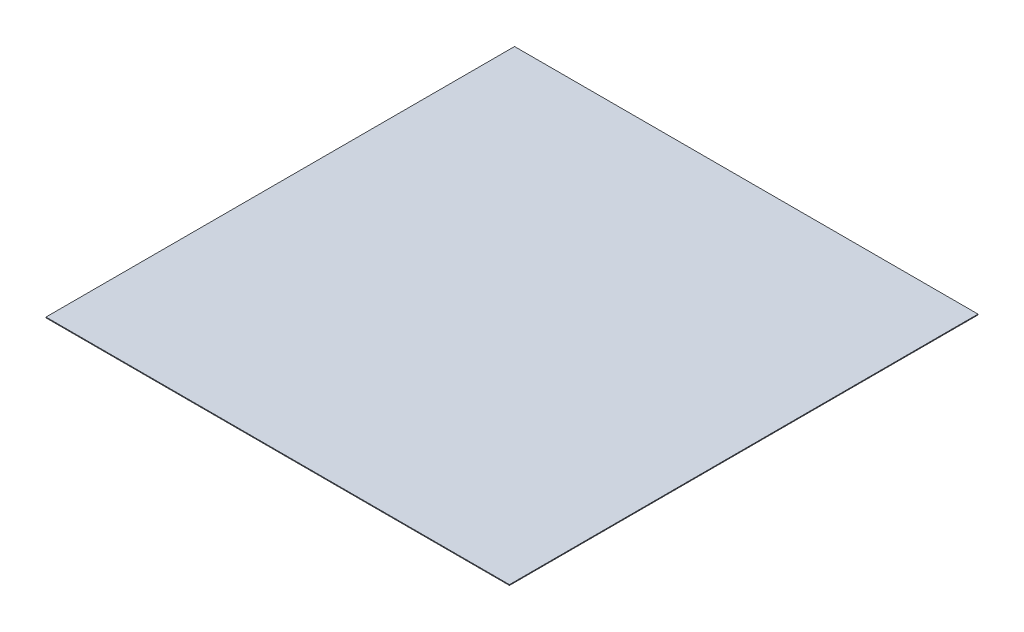
ISO-10303-21;
HEADER;
FILE_DESCRIPTION(('STEP AP214'),'2;1');
FILE_NAME('part.step','',(''),(''),'','','');
FILE_SCHEMA(('AUTOMOTIVE_DESIGN { 1 0 10303 214 1 1 1 1 }'));
ENDSEC;
DATA;
#1=APPLICATION_CONTEXT('core data for automotive mechanical design processes');
#2=APPLICATION_PROTOCOL_DEFINITION('international standard','automotive_design',2000,#1);
#3=PRODUCT_CONTEXT('',#1,'mechanical');
#4=PRODUCT('Part','Part','',(#3));
#5=PRODUCT_RELATED_PRODUCT_CATEGORY('part','',(#4));
#6=PRODUCT_DEFINITION_FORMATION('','',#4);
#7=PRODUCT_DEFINITION_CONTEXT('part definition',#1,'design');
#8=PRODUCT_DEFINITION('design','',#6,#7);
#9=PRODUCT_DEFINITION_SHAPE('','',#8);
#10=(LENGTH_UNIT() NAMED_UNIT(*) SI_UNIT(.MILLI.,.METRE.));
#11=(NAMED_UNIT(*) PLANE_ANGLE_UNIT() SI_UNIT($,.RADIAN.));
#12=(NAMED_UNIT(*) SI_UNIT($,.STERADIAN.) SOLID_ANGLE_UNIT());
#13=UNCERTAINTY_MEASURE_WITH_UNIT(LENGTH_MEASURE(1.E-05),#10,'distance_accuracy_value','');
#14=(GEOMETRIC_REPRESENTATION_CONTEXT(3) GLOBAL_UNCERTAINTY_ASSIGNED_CONTEXT((#13)) GLOBAL_UNIT_ASSIGNED_CONTEXT((#10,
#11,#12)) REPRESENTATION_CONTEXT('',''));
#15=CARTESIAN_POINT('',(0.,0.,0.));
#16=DIRECTION('',(0.,0.,1.));
#17=DIRECTION('',(1.,0.,0.));
#18=AXIS2_PLACEMENT_3D('',#15,#16,#17);
#19=CARTESIAN_POINT('',(455.,1.5,460.));
#20=DIRECTION('',(-1.,0.,0.));
#21=DIRECTION('',(0.,0.,1.));
#22=AXIS2_PLACEMENT_3D('',#19,#20,#21);
#23=PLANE('',#22);
#24=DIRECTION('',(0.,0.,-1.));
#25=VECTOR('',#24,1.);
#26=CARTESIAN_POINT('',(455.,0.,460.));
#27=LINE('',#26,#25);
#28=CARTESIAN_POINT('',(455.,0.,460.));
#29=VERTEX_POINT('',#28);
#30=CARTESIAN_POINT('',(455.,0.,-460.));
#31=VERTEX_POINT('',#30);
#32=EDGE_CURVE('E101',#29,#31,#27,.T.);
#33=ORIENTED_EDGE('',*,*,#32,.T.);
#34=DIRECTION('',(0.,-1.,0.));
#35=VECTOR('',#34,1.);
#36=CARTESIAN_POINT('',(455.,1.5,-460.));
#37=LINE('',#36,#35);
#38=CARTESIAN_POINT('',(455.,1.5,-460.));
#39=VERTEX_POINT('',#38);
#40=EDGE_CURVE('E11',#39,#31,#37,.T.);
#41=ORIENTED_EDGE('',*,*,#40,.F.);
#42=DIRECTION('',(0.,0.,-1.));
#43=VECTOR('',#42,1.);
#44=CARTESIAN_POINT('',(455.,1.5,460.));
#45=LINE('',#44,#43);
#46=CARTESIAN_POINT('',(455.,1.5,460.));
#47=VERTEX_POINT('',#46);
#48=EDGE_CURVE('E89',#47,#39,#45,.T.);
#49=ORIENTED_EDGE('',*,*,#48,.F.);
#50=DIRECTION('',(0.,-1.,0.));
#51=VECTOR('',#50,1.);
#52=CARTESIAN_POINT('',(455.,1.5,460.));
#53=LINE('',#52,#51);
#54=EDGE_CURVE('E97',#47,#29,#53,.T.);
#55=ORIENTED_EDGE('',*,*,#54,.T.);
#56=EDGE_LOOP('',(#33,#41,#49,#55));
#57=FACE_BOUND('',#56,.T.);
#58=ADVANCED_FACE('F38',(#57),#23,.F.);
#59=CARTESIAN_POINT('',(-455.,1.5,-460.));
#60=DIRECTION('',(0.,0.,1.));
#61=DIRECTION('',(1.,0.,0.));
#62=AXIS2_PLACEMENT_3D('',#59,#60,#61);
#63=PLANE('',#62);
#64=DIRECTION('',(-1.,0.,0.));
#65=VECTOR('',#64,1.);
#66=CARTESIAN_POINT('',(-455.,0.,-460.));
#67=LINE('',#66,#65);
#68=CARTESIAN_POINT('',(-455.,0.,-460.));
#69=VERTEX_POINT('',#68);
#70=EDGE_CURVE('E93',#31,#69,#67,.T.);
#71=ORIENTED_EDGE('',*,*,#70,.T.);
#72=DIRECTION('',(0.,-1.,0.));
#73=VECTOR('',#72,1.);
#74=CARTESIAN_POINT('',(-455.,1.5,-460.));
#75=LINE('',#74,#73);
#76=CARTESIAN_POINT('',(-455.,1.5,-460.));
#77=VERTEX_POINT('',#76);
#78=EDGE_CURVE('E46',#77,#69,#75,.T.);
#79=ORIENTED_EDGE('',*,*,#78,.F.);
#80=DIRECTION('',(-1.,0.,0.));
#81=VECTOR('',#80,1.);
#82=CARTESIAN_POINT('',(-455.,1.5,-460.));
#83=LINE('',#82,#81);
#84=EDGE_CURVE('E84',#39,#77,#83,.T.);
#85=ORIENTED_EDGE('',*,*,#84,.F.);
#86=ORIENTED_EDGE('',*,*,#40,.T.);
#87=EDGE_LOOP('',(#71,#79,#85,#86));
#88=FACE_BOUND('',#87,.T.);
#89=ADVANCED_FACE('F92',(#88),#63,.F.);
#90=CARTESIAN_POINT('',(-455.,1.5,460.));
#91=DIRECTION('',(1.,0.,0.));
#92=DIRECTION('',(0.,0.,-1.));
#93=AXIS2_PLACEMENT_3D('',#90,#91,#92);
#94=PLANE('',#93);
#95=DIRECTION('',(0.,0.,1.));
#96=VECTOR('',#95,1.);
#97=CARTESIAN_POINT('',(-455.,0.,460.));
#98=LINE('',#97,#96);
#99=CARTESIAN_POINT('',(-455.,0.,460.));
#100=VERTEX_POINT('',#99);
#101=EDGE_CURVE('E71',#69,#100,#98,.T.);
#102=ORIENTED_EDGE('',*,*,#101,.T.);
#103=DIRECTION('',(0.,-1.,0.));
#104=VECTOR('',#103,1.);
#105=CARTESIAN_POINT('',(-455.,1.5,460.));
#106=LINE('',#105,#104);
#107=CARTESIAN_POINT('',(-455.,1.5,460.));
#108=VERTEX_POINT('',#107);
#109=EDGE_CURVE('E94',#108,#100,#106,.T.);
#110=ORIENTED_EDGE('',*,*,#109,.F.);
#111=DIRECTION('',(0.,0.,1.));
#112=VECTOR('',#111,1.);
#113=CARTESIAN_POINT('',(-455.,1.5,460.));
#114=LINE('',#113,#112);
#115=EDGE_CURVE('E87',#77,#108,#114,.T.);
#116=ORIENTED_EDGE('',*,*,#115,.F.);
#117=ORIENTED_EDGE('',*,*,#78,.T.);
#118=EDGE_LOOP('',(#102,#110,#116,#117));
#119=FACE_BOUND('',#118,.T.);
#120=ADVANCED_FACE('F95',(#119),#94,.F.);
#121=CARTESIAN_POINT('',(-455.,1.5,460.));
#122=DIRECTION('',(0.,0.,-1.));
#123=DIRECTION('',(-1.,0.,0.));
#124=AXIS2_PLACEMENT_3D('',#121,#122,#123);
#125=PLANE('',#124);
#126=DIRECTION('',(1.,0.,0.));
#127=VECTOR('',#126,1.);
#128=CARTESIAN_POINT('',(-455.,0.,460.));
#129=LINE('',#128,#127);
#130=EDGE_CURVE('E77',#100,#29,#129,.T.);
#131=ORIENTED_EDGE('',*,*,#130,.T.);
#132=ORIENTED_EDGE('',*,*,#54,.F.);
#133=DIRECTION('',(1.,0.,0.));
#134=VECTOR('',#133,1.);
#135=CARTESIAN_POINT('',(-455.,1.5,460.));
#136=LINE('',#135,#134);
#137=EDGE_CURVE('E54',#108,#47,#136,.T.);
#138=ORIENTED_EDGE('',*,*,#137,.F.);
#139=ORIENTED_EDGE('',*,*,#109,.T.);
#140=EDGE_LOOP('',(#131,#132,#138,#139));
#141=FACE_BOUND('',#140,.T.);
#142=ADVANCED_FACE('F108',(#141),#125,.F.);
#143=CARTESIAN_POINT('',(0.,1.5,0.));
#144=DIRECTION('',(0.,-1.,0.));
#145=DIRECTION('',(0.,0.,-1.));
#146=AXIS2_PLACEMENT_3D('',#143,#144,#145);
#147=PLANE('',#146);
#148=ORIENTED_EDGE('',*,*,#48,.T.);
#149=ORIENTED_EDGE('',*,*,#84,.T.);
#150=ORIENTED_EDGE('',*,*,#115,.T.);
#151=ORIENTED_EDGE('',*,*,#137,.T.);
#152=EDGE_LOOP('',(#148,#149,#150,#151));
#153=FACE_BOUND('',#152,.T.);
#154=ADVANCED_FACE('F85',(#153),#147,.F.);
#155=CARTESIAN_POINT('',(0.,0.,0.));
#156=DIRECTION('',(0.,-1.,0.));
#157=DIRECTION('',(0.,0.,-1.));
#158=AXIS2_PLACEMENT_3D('',#155,#156,#157);
#159=PLANE('',#158);
#160=ORIENTED_EDGE('',*,*,#32,.F.);
#161=ORIENTED_EDGE('',*,*,#130,.F.);
#162=ORIENTED_EDGE('',*,*,#101,.F.);
#163=ORIENTED_EDGE('',*,*,#70,.F.);
#164=EDGE_LOOP('',(#160,#161,#162,#163));
#165=FACE_BOUND('',#164,.T.);
#166=ADVANCED_FACE('F111',(#165),#159,.T.);
#167=CLOSED_SHELL('',(#58,#89,#120,#142,#154,#166));
#168=MANIFOLD_SOLID_BREP('B2',#167);
#169=ADVANCED_BREP_SHAPE_REPRESENTATION('',(#18,#168),#14);
#170=SHAPE_DEFINITION_REPRESENTATION(#9,#169);
ENDSEC;
END-ISO-10303-21;
